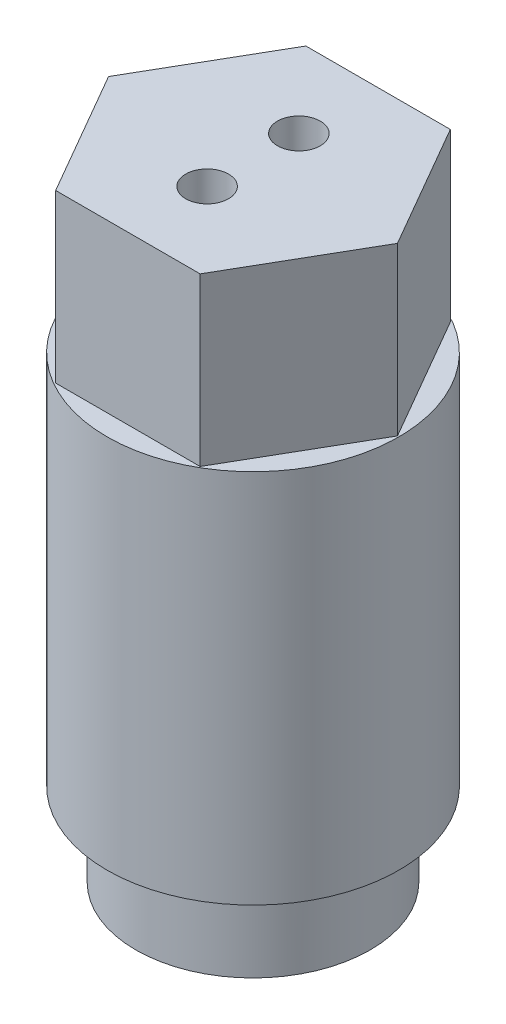
ISO-10303-21;
HEADER;
FILE_DESCRIPTION(('STEP AP214'),'2;1');
FILE_NAME('part.step','',(''),(''),'','','');
FILE_SCHEMA(('AUTOMOTIVE_DESIGN { 1 0 10303 214 1 1 1 1 }'));
ENDSEC;
DATA;
#1=APPLICATION_CONTEXT('core data for automotive mechanical design processes');
#2=APPLICATION_PROTOCOL_DEFINITION('international standard','automotive_design',2000,#1);
#3=PRODUCT_CONTEXT('',#1,'mechanical');
#4=PRODUCT('Part','Part','',(#3));
#5=PRODUCT_RELATED_PRODUCT_CATEGORY('part','',(#4));
#6=PRODUCT_DEFINITION_FORMATION('','',#4);
#7=PRODUCT_DEFINITION_CONTEXT('part definition',#1,'design');
#8=PRODUCT_DEFINITION('design','',#6,#7);
#9=PRODUCT_DEFINITION_SHAPE('','',#8);
#10=(LENGTH_UNIT() NAMED_UNIT(*) SI_UNIT(.MILLI.,.METRE.));
#11=(NAMED_UNIT(*) PLANE_ANGLE_UNIT() SI_UNIT($,.RADIAN.));
#12=(NAMED_UNIT(*) SI_UNIT($,.STERADIAN.) SOLID_ANGLE_UNIT());
#13=UNCERTAINTY_MEASURE_WITH_UNIT(LENGTH_MEASURE(1.E-05),#10,'distance_accuracy_value','');
#14=(GEOMETRIC_REPRESENTATION_CONTEXT(3) GLOBAL_UNCERTAINTY_ASSIGNED_CONTEXT((#13)) GLOBAL_UNIT_ASSIGNED_CONTEXT((#10,
#11,#12)) REPRESENTATION_CONTEXT('',''));
#15=CARTESIAN_POINT('',(0.,0.,0.));
#16=DIRECTION('',(0.,0.,1.));
#17=DIRECTION('',(1.,0.,0.));
#18=AXIS2_PLACEMENT_3D('',#15,#16,#17);
#19=CARTESIAN_POINT('',(0.,28.575,0.));
#20=DIRECTION('',(0.,-1.,0.));
#21=DIRECTION('',(0.,0.,-1.));
#22=AXIS2_PLACEMENT_3D('',#19,#20,#21);
#23=CYLINDRICAL_SURFACE('',#22,11.1125);
#24=CARTESIAN_POINT('',(0.,28.575,0.));
#25=DIRECTION('',(0.,1.,0.));
#26=DIRECTION('',(0.,0.,1.));
#27=AXIS2_PLACEMENT_3D('',#24,#25,#26);
#28=CIRCLE('',#27,11.1125);
#29=CARTESIAN_POINT('',(0.,28.575,11.1125));
#30=VERTEX_POINT('',#29);
#31=EDGE_CURVE('E11',#30,#30,#28,.T.);
#32=ORIENTED_EDGE('',*,*,#31,.F.);
#33=EDGE_LOOP('',(#32));
#34=FACE_BOUND('',#33,.T.);
#35=CARTESIAN_POINT('',(0.,0.,0.));
#36=DIRECTION('',(0.,1.,0.));
#37=DIRECTION('',(0.,0.,1.));
#38=AXIS2_PLACEMENT_3D('',#35,#36,#37);
#39=CIRCLE('',#38,11.1125);
#40=CARTESIAN_POINT('',(0.,0.,11.1125));
#41=VERTEX_POINT('',#40);
#42=EDGE_CURVE('E47',#41,#41,#39,.T.);
#43=ORIENTED_EDGE('',*,*,#42,.T.);
#44=EDGE_LOOP('',(#43));
#45=FACE_BOUND('',#44,.T.);
#46=ADVANCED_FACE('F44',(#34,#45),#23,.T.);
#47=CARTESIAN_POINT('',(0.,28.575,0.));
#48=DIRECTION('',(0.,1.,0.));
#49=DIRECTION('',(0.,0.,1.));
#50=AXIS2_PLACEMENT_3D('',#47,#48,#49);
#51=PLANE('',#50);
#52=DIRECTION('',(-0.5,0.,-0.866025403784438));
#53=VECTOR('',#52,1.);
#54=CARTESIAN_POINT('',(10.9985226280624,28.575,0.));
#55=LINE('',#54,#53);
#56=CARTESIAN_POINT('',(10.9985226280624,28.575,0.));
#57=VERTEX_POINT('',#56);
#58=CARTESIAN_POINT('',(5.49926131403118,28.575,-9.525));
#59=VERTEX_POINT('',#58);
#60=EDGE_CURVE('E119',#57,#59,#55,.T.);
#61=ORIENTED_EDGE('',*,*,#60,.F.);
#62=DIRECTION('',(0.5,0.,-0.866025403784439));
#63=VECTOR('',#62,1.);
#64=CARTESIAN_POINT('',(5.49926131403118,28.575,9.525));
#65=LINE('',#64,#63);
#66=CARTESIAN_POINT('',(5.49926131403118,28.575,9.525));
#67=VERTEX_POINT('',#66);
#68=EDGE_CURVE('E128',#67,#57,#65,.T.);
#69=ORIENTED_EDGE('',*,*,#68,.F.);
#70=DIRECTION('',(1.,0.,0.));
#71=VECTOR('',#70,1.);
#72=CARTESIAN_POINT('',(-5.49926131403119,28.575,9.525));
#73=LINE('',#72,#71);
#74=CARTESIAN_POINT('',(-5.49926131403119,28.575,9.525));
#75=VERTEX_POINT('',#74);
#76=EDGE_CURVE('E150',#75,#67,#73,.T.);
#77=ORIENTED_EDGE('',*,*,#76,.F.);
#78=DIRECTION('',(0.5,0.,0.866025403784439));
#79=VECTOR('',#78,1.);
#80=CARTESIAN_POINT('',(-10.9985226280624,28.575,0.));
#81=LINE('',#80,#79);
#82=CARTESIAN_POINT('',(-10.9985226280624,28.575,0.));
#83=VERTEX_POINT('',#82);
#84=EDGE_CURVE('E147',#83,#75,#81,.T.);
#85=ORIENTED_EDGE('',*,*,#84,.F.);
#86=DIRECTION('',(-0.5,0.,0.866025403784439));
#87=VECTOR('',#86,1.);
#88=CARTESIAN_POINT('',(-5.49926131403119,28.575,-9.525));
#89=LINE('',#88,#87);
#90=CARTESIAN_POINT('',(-5.49926131403119,28.575,-9.525));
#91=VERTEX_POINT('',#90);
#92=EDGE_CURVE('E144',#91,#83,#89,.T.);
#93=ORIENTED_EDGE('',*,*,#92,.F.);
#94=DIRECTION('',(-1.,0.,0.));
#95=VECTOR('',#94,1.);
#96=CARTESIAN_POINT('',(5.49926131403118,28.575,-9.525));
#97=LINE('',#96,#95);
#98=EDGE_CURVE('E141',#59,#91,#97,.T.);
#99=ORIENTED_EDGE('',*,*,#98,.F.);
#100=EDGE_LOOP('',(#61,#69,#77,#85,#93,#99));
#101=FACE_BOUND('',#100,.T.);
#102=ORIENTED_EDGE('',*,*,#31,.T.);
#103=EDGE_LOOP('',(#102));
#104=FACE_BOUND('',#103,.T.);
#105=ADVANCED_FACE('F181',(#101,#104),#51,.T.);
#106=CARTESIAN_POINT('',(0.,0.,0.));
#107=DIRECTION('',(0.,1.,0.));
#108=DIRECTION('',(0.,0.,1.));
#109=AXIS2_PLACEMENT_3D('',#106,#107,#108);
#110=PLANE('',#109);
#111=ORIENTED_EDGE('',*,*,#42,.F.);
#112=EDGE_LOOP('',(#111));
#113=FACE_BOUND('',#112,.T.);
#114=CARTESIAN_POINT('',(0.,0.,0.));
#115=DIRECTION('',(0.,1.,0.));
#116=DIRECTION('',(0.,0.,1.));
#117=AXIS2_PLACEMENT_3D('',#114,#115,#116);
#118=CIRCLE('',#117,7.69620000568349);
#119=CARTESIAN_POINT('',(0.,0.,7.69620000568349));
#120=VERTEX_POINT('',#119);
#121=EDGE_CURVE('E184',#120,#120,#118,.T.);
#122=ORIENTED_EDGE('',*,*,#121,.T.);
#123=EDGE_LOOP('',(#122));
#124=FACE_BOUND('',#123,.T.);
#125=ADVANCED_FACE('F177',(#113,#124),#110,.F.);
#126=CARTESIAN_POINT('',(10.9985226280624,41.275,0.));
#127=DIRECTION('',(-0.866025403784438,0.,0.5));
#128=DIRECTION('',(0.5,0.,0.866025403784438));
#129=AXIS2_PLACEMENT_3D('',#126,#127,#128);
#130=PLANE('',#129);
#131=ORIENTED_EDGE('',*,*,#60,.T.);
#132=DIRECTION('',(0.,-1.,0.));
#133=VECTOR('',#132,1.);
#134=CARTESIAN_POINT('',(5.49926131403118,41.275,-9.525));
#135=LINE('',#134,#133);
#136=CARTESIAN_POINT('',(5.49926131403118,41.275,-9.525));
#137=VERTEX_POINT('',#136);
#138=EDGE_CURVE('E169',#137,#59,#135,.T.);
#139=ORIENTED_EDGE('',*,*,#138,.F.);
#140=DIRECTION('',(-0.5,0.,-0.866025403784438));
#141=VECTOR('',#140,1.);
#142=CARTESIAN_POINT('',(10.9985226280624,41.275,0.));
#143=LINE('',#142,#141);
#144=CARTESIAN_POINT('',(10.9985226280624,41.275,0.));
#145=VERTEX_POINT('',#144);
#146=EDGE_CURVE('E124',#145,#137,#143,.T.);
#147=ORIENTED_EDGE('',*,*,#146,.F.);
#148=DIRECTION('',(0.,-1.,0.));
#149=VECTOR('',#148,1.);
#150=CARTESIAN_POINT('',(10.9985226280624,41.275,0.));
#151=LINE('',#150,#149);
#152=EDGE_CURVE('E138',#145,#57,#151,.T.);
#153=ORIENTED_EDGE('',*,*,#152,.T.);
#154=EDGE_LOOP('',(#131,#139,#147,#153));
#155=FACE_BOUND('',#154,.T.);
#156=ADVANCED_FACE('F180',(#155),#130,.F.);
#157=CARTESIAN_POINT('',(5.49926131403118,41.275,-9.525));
#158=DIRECTION('',(0.,0.,1.));
#159=DIRECTION('',(1.,0.,0.));
#160=AXIS2_PLACEMENT_3D('',#157,#158,#159);
#161=PLANE('',#160);
#162=ORIENTED_EDGE('',*,*,#98,.T.);
#163=DIRECTION('',(0.,-1.,0.));
#164=VECTOR('',#163,1.);
#165=CARTESIAN_POINT('',(-5.49926131403119,41.275,-9.525));
#166=LINE('',#165,#164);
#167=CARTESIAN_POINT('',(-5.49926131403119,41.275,-9.525));
#168=VERTEX_POINT('',#167);
#169=EDGE_CURVE('E166',#168,#91,#166,.T.);
#170=ORIENTED_EDGE('',*,*,#169,.F.);
#171=DIRECTION('',(-1.,0.,0.));
#172=VECTOR('',#171,1.);
#173=CARTESIAN_POINT('',(5.49926131403118,41.275,-9.525));
#174=LINE('',#173,#172);
#175=EDGE_CURVE('E127',#137,#168,#174,.T.);
#176=ORIENTED_EDGE('',*,*,#175,.F.);
#177=ORIENTED_EDGE('',*,*,#138,.T.);
#178=EDGE_LOOP('',(#162,#170,#176,#177));
#179=FACE_BOUND('',#178,.T.);
#180=ADVANCED_FACE('F250',(#179),#161,.F.);
#181=CARTESIAN_POINT('',(-5.49926131403119,41.275,-9.525));
#182=DIRECTION('',(0.866025403784439,0.,0.5));
#183=DIRECTION('',(0.5,0.,-0.866025403784439));
#184=AXIS2_PLACEMENT_3D('',#181,#182,#183);
#185=PLANE('',#184);
#186=ORIENTED_EDGE('',*,*,#92,.T.);
#187=DIRECTION('',(0.,-1.,0.));
#188=VECTOR('',#187,1.);
#189=CARTESIAN_POINT('',(-10.9985226280624,41.275,0.));
#190=LINE('',#189,#188);
#191=CARTESIAN_POINT('',(-10.9985226280624,41.275,0.));
#192=VERTEX_POINT('',#191);
#193=EDGE_CURVE('E163',#192,#83,#190,.T.);
#194=ORIENTED_EDGE('',*,*,#193,.F.);
#195=DIRECTION('',(-0.5,0.,0.866025403784439));
#196=VECTOR('',#195,1.);
#197=CARTESIAN_POINT('',(-5.49926131403119,41.275,-9.525));
#198=LINE('',#197,#196);
#199=EDGE_CURVE('E130',#168,#192,#198,.T.);
#200=ORIENTED_EDGE('',*,*,#199,.F.);
#201=ORIENTED_EDGE('',*,*,#169,.T.);
#202=EDGE_LOOP('',(#186,#194,#200,#201));
#203=FACE_BOUND('',#202,.T.);
#204=ADVANCED_FACE('F254',(#203),#185,.F.);
#205=CARTESIAN_POINT('',(-10.9985226280624,41.275,0.));
#206=DIRECTION('',(0.866025403784439,0.,-0.5));
#207=DIRECTION('',(-0.5,0.,-0.866025403784439));
#208=AXIS2_PLACEMENT_3D('',#205,#206,#207);
#209=PLANE('',#208);
#210=ORIENTED_EDGE('',*,*,#84,.T.);
#211=DIRECTION('',(0.,-1.,0.));
#212=VECTOR('',#211,1.);
#213=CARTESIAN_POINT('',(-5.49926131403119,41.275,9.525));
#214=LINE('',#213,#212);
#215=CARTESIAN_POINT('',(-5.49926131403119,41.275,9.525));
#216=VERTEX_POINT('',#215);
#217=EDGE_CURVE('E160',#216,#75,#214,.T.);
#218=ORIENTED_EDGE('',*,*,#217,.F.);
#219=DIRECTION('',(0.5,0.,0.866025403784439));
#220=VECTOR('',#219,1.);
#221=CARTESIAN_POINT('',(-10.9985226280624,41.275,0.));
#222=LINE('',#221,#220);
#223=EDGE_CURVE('E132',#192,#216,#222,.T.);
#224=ORIENTED_EDGE('',*,*,#223,.F.);
#225=ORIENTED_EDGE('',*,*,#193,.T.);
#226=EDGE_LOOP('',(#210,#218,#224,#225));
#227=FACE_BOUND('',#226,.T.);
#228=ADVANCED_FACE('F257',(#227),#209,.F.);
#229=CARTESIAN_POINT('',(-5.49926131403119,41.275,9.525));
#230=DIRECTION('',(0.,0.,-1.));
#231=DIRECTION('',(-1.,0.,0.));
#232=AXIS2_PLACEMENT_3D('',#229,#230,#231);
#233=PLANE('',#232);
#234=ORIENTED_EDGE('',*,*,#76,.T.);
#235=DIRECTION('',(0.,-1.,0.));
#236=VECTOR('',#235,1.);
#237=CARTESIAN_POINT('',(5.49926131403118,41.275,9.525));
#238=LINE('',#237,#236);
#239=CARTESIAN_POINT('',(5.49926131403118,41.275,9.525));
#240=VERTEX_POINT('',#239);
#241=EDGE_CURVE('E157',#240,#67,#238,.T.);
#242=ORIENTED_EDGE('',*,*,#241,.F.);
#243=DIRECTION('',(1.,0.,0.));
#244=VECTOR('',#243,1.);
#245=CARTESIAN_POINT('',(-5.49926131403119,41.275,9.525));
#246=LINE('',#245,#244);
#247=EDGE_CURVE('E134',#216,#240,#246,.T.);
#248=ORIENTED_EDGE('',*,*,#247,.F.);
#249=ORIENTED_EDGE('',*,*,#217,.T.);
#250=EDGE_LOOP('',(#234,#242,#248,#249));
#251=FACE_BOUND('',#250,.T.);
#252=ADVANCED_FACE('F261',(#251),#233,.F.);
#253=CARTESIAN_POINT('',(5.49926131403118,41.275,9.525));
#254=DIRECTION('',(-0.866025403784439,0.,-0.5));
#255=DIRECTION('',(-0.5,0.,0.866025403784439));
#256=AXIS2_PLACEMENT_3D('',#253,#254,#255);
#257=PLANE('',#256);
#258=ORIENTED_EDGE('',*,*,#68,.T.);
#259=ORIENTED_EDGE('',*,*,#152,.F.);
#260=DIRECTION('',(0.5,0.,-0.866025403784439));
#261=VECTOR('',#260,1.);
#262=CARTESIAN_POINT('',(5.49926131403118,41.275,9.525));
#263=LINE('',#262,#261);
#264=EDGE_CURVE('E136',#240,#145,#263,.T.);
#265=ORIENTED_EDGE('',*,*,#264,.F.);
#266=ORIENTED_EDGE('',*,*,#241,.T.);
#267=EDGE_LOOP('',(#258,#259,#265,#266));
#268=FACE_BOUND('',#267,.T.);
#269=ADVANCED_FACE('F265',(#268),#257,.F.);
#270=CARTESIAN_POINT('',(0.,41.275,0.));
#271=DIRECTION('',(0.,1.,0.));
#272=DIRECTION('',(0.,0.,1.));
#273=AXIS2_PLACEMENT_3D('',#270,#271,#272);
#274=PLANE('',#273);
#275=CARTESIAN_POINT('',(0.,41.275,-3.4925));
#276=DIRECTION('',(0.,-1.,0.));
#277=DIRECTION('',(0.,0.,-1.));
#278=AXIS2_PLACEMENT_3D('',#275,#276,#277);
#279=CIRCLE('',#278,1.63195);
#280=CARTESIAN_POINT('',(0.,41.275,-5.12445));
#281=VERTEX_POINT('',#280);
#282=EDGE_CURVE('E292',#281,#281,#279,.T.);
#283=ORIENTED_EDGE('',*,*,#282,.T.);
#284=EDGE_LOOP('',(#283));
#285=FACE_BOUND('',#284,.T.);
#286=CARTESIAN_POINT('',(0.,41.275,3.4925));
#287=DIRECTION('',(0.,-1.,0.));
#288=DIRECTION('',(0.,0.,-1.));
#289=AXIS2_PLACEMENT_3D('',#286,#287,#288);
#290=CIRCLE('',#289,1.63195);
#291=CARTESIAN_POINT('',(0.,41.275,1.86055));
#292=VERTEX_POINT('',#291);
#293=EDGE_CURVE('E286',#292,#292,#290,.T.);
#294=ORIENTED_EDGE('',*,*,#293,.T.);
#295=EDGE_LOOP('',(#294));
#296=FACE_BOUND('',#295,.T.);
#297=ORIENTED_EDGE('',*,*,#146,.T.);
#298=ORIENTED_EDGE('',*,*,#175,.T.);
#299=ORIENTED_EDGE('',*,*,#199,.T.);
#300=ORIENTED_EDGE('',*,*,#223,.T.);
#301=ORIENTED_EDGE('',*,*,#247,.T.);
#302=ORIENTED_EDGE('',*,*,#264,.T.);
#303=EDGE_LOOP('',(#297,#298,#299,#300,#301,#302));
#304=FACE_BOUND('',#303,.T.);
#305=ADVANCED_FACE('F269',(#285,#296,#304),#274,.T.);
#306=CARTESIAN_POINT('',(0.,-6.35,0.));
#307=DIRECTION('',(0.,1.,0.));
#308=DIRECTION('',(0.,0.,1.));
#309=AXIS2_PLACEMENT_3D('',#306,#307,#308);
#310=CYLINDRICAL_SURFACE('',#309,8.9281);
#311=CARTESIAN_POINT('',(0.,-0.7112378,0.));
#312=DIRECTION('',(0.,1.,0.));
#313=DIRECTION('',(0.,0.,1.));
#314=AXIS2_PLACEMENT_3D('',#311,#312,#313);
#315=CIRCLE('',#314,8.9281);
#316=CARTESIAN_POINT('',(0.,-0.7112378,8.9281));
#317=VERTEX_POINT('',#316);
#318=EDGE_CURVE('E187',#317,#317,#315,.T.);
#319=ORIENTED_EDGE('',*,*,#318,.F.);
#320=EDGE_LOOP('',(#319));
#321=FACE_BOUND('',#320,.T.);
#322=CARTESIAN_POINT('',(0.,-6.35,0.));
#323=DIRECTION('',(0.,-1.,0.));
#324=DIRECTION('',(0.,0.,-1.));
#325=AXIS2_PLACEMENT_3D('',#322,#323,#324);
#326=CIRCLE('',#325,8.9281);
#327=CARTESIAN_POINT('',(0.,-6.35,-8.9281));
#328=VERTEX_POINT('',#327);
#329=EDGE_CURVE('E117',#328,#328,#326,.T.);
#330=ORIENTED_EDGE('',*,*,#329,.F.);
#331=EDGE_LOOP('',(#330));
#332=FACE_BOUND('',#331,.T.);
#333=ADVANCED_FACE('F273',(#321,#332),#310,.T.);
#334=CARTESIAN_POINT('',(0.,-6.35,0.));
#335=DIRECTION('',(0.,-1.,0.));
#336=DIRECTION('',(0.,0.,-1.));
#337=AXIS2_PLACEMENT_3D('',#334,#335,#336);
#338=PLANE('',#337);
#339=CARTESIAN_POINT('',(0.,-6.35,0.));
#340=DIRECTION('',(0.,-1.,0.));
#341=DIRECTION('',(0.,0.,-1.));
#342=AXIS2_PLACEMENT_3D('',#339,#340,#341);
#343=CIRCLE('',#342,6.34999999999999);
#344=CARTESIAN_POINT('',(0.,-6.35,-6.34999999999999));
#345=VERTEX_POINT('',#344);
#346=EDGE_CURVE('E114',#345,#345,#343,.T.);
#347=ORIENTED_EDGE('',*,*,#346,.F.);
#348=EDGE_LOOP('',(#347));
#349=FACE_BOUND('',#348,.T.);
#350=ORIENTED_EDGE('',*,*,#329,.T.);
#351=EDGE_LOOP('',(#350));
#352=FACE_BOUND('',#351,.T.);
#353=ADVANCED_FACE('F105',(#349,#352),#338,.T.);
#354=CARTESIAN_POINT('',(0.,24.759535069175,0.));
#355=DIRECTION('',(0.,-1.,0.));
#356=DIRECTION('',(0.,0.,-1.));
#357=AXIS2_PLACEMENT_3D('',#354,#355,#356);
#358=CONICAL_SURFACE('',#357,6.34999999999999,1.02974425867665);
#359=CARTESIAN_POINT('',(0.,28.575,0.));
#360=VERTEX_POINT('',#359);
#361=VERTEX_LOOP('',#360);
#362=FACE_BOUND('',#361,.T.);
#363=CARTESIAN_POINT('',(0.,24.759535069175,0.));
#364=DIRECTION('',(0.,-1.,0.));
#365=DIRECTION('',(0.,0.,-1.));
#366=AXIS2_PLACEMENT_3D('',#363,#364,#365);
#367=CIRCLE('',#366,6.34999999999999);
#368=CARTESIAN_POINT('',(0.,24.759535069175,6.34999999999999));
#369=VERTEX_POINT('',#368);
#370=CARTESIAN_POINT('',(0.,24.759535069175,-6.34999999999999));
#371=VERTEX_POINT('',#370);
#372=EDGE_CURVE('E109',#369,#371,#367,.T.);
#373=ORIENTED_EDGE('',*,*,#372,.T.);
#374=CARTESIAN_POINT('',(-2.12664299759173,25.0871954921764,-5.40108476646814));
#375=CARTESIAN_POINT('',(-2.23846037295355,25.1322413075604,-5.27648419595228));
#376=CARTESIAN_POINT('',(-2.33858096757132,25.1814312567212,-5.14282956546129));
#377=CARTESIAN_POINT('',(-2.51318670221022,25.2872912956615,-4.86236505142527));
#378=CARTESIAN_POINT('',(-2.58765588543493,25.3439660112263,-4.71554705073262));
#379=CARTESIAN_POINT('',(-2.70963998923854,25.4637978319487,-4.41418641417808));
#380=CARTESIAN_POINT('',(-2.75722926745167,25.5269364779785,-4.25966638757051));
#381=CARTESIAN_POINT('',(-2.8256059686795,25.659021048249,-3.94728930952049));
#382=CARTESIAN_POINT('',(-2.84639423835688,25.7279667889662,-3.78943236365379));
#383=CARTESIAN_POINT('',(-2.86220999114231,25.8748966248964,-3.46600899481421));
#384=CARTESIAN_POINT('',(-2.85574156897064,25.9531700843033,-3.30050168673523));
#385=CARTESIAN_POINT('',(-2.81508890284434,26.1145116874024,-2.97533910877659));
#386=CARTESIAN_POINT('',(-2.78089465270973,26.1975815520503,-2.81568597339902));
#387=CARTESIAN_POINT('',(-2.68348847448705,26.3737399559297,-2.49543509864929));
#388=CARTESIAN_POINT('',(-2.61839384394084,26.4671214429146,-2.33557045530971));
#389=CARTESIAN_POINT('',(-2.46185091569495,26.6574612248176,-2.03173242761895));
#390=CARTESIAN_POINT('',(-2.37039743031442,26.7544202205457,-1.88776217916202));
#391=CARTESIAN_POINT('',(-2.15791194043633,26.9572599328709,-1.61072804464417));
#392=CARTESIAN_POINT('',(-2.03536729461402,27.0633156139409,-1.47894239470937));
#393=CARTESIAN_POINT('',(-1.8354124452997,27.2233799970871,-1.30056315143068));
#394=CARTESIAN_POINT('',(-1.76602050655992,27.2769336156279,-1.24428946533047));
#395=CARTESIAN_POINT('',(-1.62231897548546,27.3841315430701,-1.13849578944376));
#396=CARTESIAN_POINT('',(-1.54801041846045,27.4377758305754,-1.08897438448549));
#397=CARTESIAN_POINT('',(-1.40525876225021,27.5375514416632,-1.00321769194902));
#398=CARTESIAN_POINT('',(-1.33737460282511,27.5837210641243,-0.966091288262816));
#399=CARTESIAN_POINT('',(-1.19845715631155,27.6754569832397,-0.89730912824796));
#400=CARTESIAN_POINT('',(-1.12742284777422,27.7210230778853,-0.865655162920026));
#401=CARTESIAN_POINT('',(-0.982294739507047,27.8108813523633,-0.808006333332228));
#402=CARTESIAN_POINT('',(-0.908201059555941,27.8551735819543,-0.782011247768646));
#403=CARTESIAN_POINT('',(-0.794632395276379,27.9195899598528,-0.747426687446017));
#404=CARTESIAN_POINT('',(-0.756385730113449,27.940717827513,-0.736636280002973));
#405=CARTESIAN_POINT('',(-0.678972778573323,27.9819955169009,-0.716549284200653));
#406=CARTESIAN_POINT('',(-0.639806461060978,28.0021453054445,-0.707252746500671));
#407=CARTESIAN_POINT('',(-0.568692426243631,28.036946969438,-0.691977202771454));
#408=CARTESIAN_POINT('',(-0.536939626469249,28.0518700477498,-0.68571047066952));
#409=CARTESIAN_POINT('',(-0.472694070587207,28.0804450896381,-0.67417932612234));
#410=CARTESIAN_POINT('',(-0.440201561950365,28.0940974707711,-0.668914583820549));
#411=CARTESIAN_POINT('',(-0.374486776315688,28.1195863447859,-0.659451441425064));
#412=CARTESIAN_POINT('',(-0.341267536452712,28.1314291780769,-0.655249282617722));
#413=CARTESIAN_POINT('',(-0.273928695030423,28.1526604357654,-0.64795886982216));
#414=CARTESIAN_POINT('',(-0.239809588105914,28.1620501788375,-0.644870017028646));
#415=CARTESIAN_POINT('',(-0.180481873631395,28.175345519,-0.640597061495941));
#416=CARTESIAN_POINT('',(-0.155475048307056,28.1800509580596,-0.639121437467662));
#417=CARTESIAN_POINT('',(-0.105139734828962,28.1874548731418,-0.636823917901088));
#418=CARTESIAN_POINT('',(-0.0798113926448304,28.1901542289663,-0.636001735773722));
#419=CARTESIAN_POINT('',(-0.0290652282494052,28.1933327819225,-0.635035463593242));
#420=CARTESIAN_POINT('',(-0.00364780795079561,28.1938177137002,-0.634889622020363));
#421=CARTESIAN_POINT('',(0.047126344731146,28.1925429251238,-0.635275768216819));
#422=CARTESIAN_POINT('',(0.0724830683523559,28.1907828982116,-0.635807848559062));
#423=CARTESIAN_POINT('',(0.129453969657336,28.1844316392706,-0.637757242271303));
#424=CARTESIAN_POINT('',(0.160992815358319,28.1792265733584,-0.639367699024206));
#425=CARTESIAN_POINT('',(0.223430362200437,28.1660404144552,-0.643576195907396));
#426=CARTESIAN_POINT('',(0.254328347376523,28.1580563770018,-0.646175283815119));
#427=CARTESIAN_POINT('',(0.315618114618752,28.1398822801969,-0.652315585717333));
#428=CARTESIAN_POINT('',(0.346004233946811,28.1296758502436,-0.655863838321444));
#429=CARTESIAN_POINT('',(0.406050489466419,28.1076504940499,-0.663834872832706));
#430=CARTESIAN_POINT('',(0.435710784541532,28.0958319245003,-0.668257461387329));
#431=CARTESIAN_POINT('',(0.504656677751439,28.0666646609015,-0.679629555700411));
#432=CARTESIAN_POINT('',(0.543678143587425,28.0488281000857,-0.686921735697788));
#433=CARTESIAN_POINT('',(0.620719521274688,28.0117104238751,-0.702955112970444));
#434=CARTESIAN_POINT('',(0.658739210369311,27.9924289907996,-0.711696629423279));
#435=CARTESIAN_POINT('',(0.771598798948421,27.9330855767946,-0.740051614164111));
#436=CARTESIAN_POINT('',(0.845147905291342,27.891565894887,-0.761780112590294));
#437=CARTESIAN_POINT('',(0.989287988415232,27.8066815035626,-0.810635481428585));
#438=CARTESIAN_POINT('',(1.05987896331401,27.7633167929718,-0.837762355275502));
#439=CARTESIAN_POINT('',(1.19815227236435,27.6756622002175,-0.897235744652615));
#440=CARTESIAN_POINT('',(1.26583658009344,27.6313729771467,-0.929578645296516));
#441=CARTESIAN_POINT('',(1.40080564507217,27.5406234637919,-1.00069559894589));
#442=CARTESIAN_POINT('',(1.46797287793989,27.4941456393611,-1.03967057855149));
#443=CARTESIAN_POINT('',(1.59885271182327,27.4010541705752,-1.12290204456733));
#444=CARTESIAN_POINT('',(1.66256470862424,27.3544405039576,-1.16715945040828));
#445=CARTESIAN_POINT('',(1.84793352311946,27.214846374068,-1.30745318045342));
#446=CARTESIAN_POINT('',(1.96402283296709,27.121978143993,-1.41111650039977));
#447=CARTESIAN_POINT('',(2.20051323991691,26.9189071567486,-1.65994898607149));
#448=CARTESIAN_POINT('',(2.31688682183497,26.8090693370492,-1.80926958715146));
#449=CARTESIAN_POINT('',(2.51895308391179,26.5931801937141,-2.13009789878299));
#450=CARTESIAN_POINT('',(2.60462084183912,26.4871320084791,-2.30162347890615));
#451=CARTESIAN_POINT('',(2.73858754514712,26.2833753361572,-2.65572215703513));
#452=CARTESIAN_POINT('',(2.78793008367565,26.1855121242158,-2.83780970159698));
#453=CARTESIAN_POINT('',(2.84990454081526,25.9959879950338,-3.21121711977384));
#454=CARTESIAN_POINT('',(2.86255751406158,25.9043235500865,-3.40253163429697));
#455=CARTESIAN_POINT('',(2.84920818915305,25.7340310712588,-3.77508813549767));
#456=CARTESIAN_POINT('',(2.82559173940359,25.6549455281758,-3.95620506643117));
#457=CARTESIAN_POINT('',(2.74311383667071,25.5044927519066,-4.31360746608459));
#458=CARTESIAN_POINT('',(2.68426634135334,25.4331224753355,-4.4898948192549));
#459=CARTESIAN_POINT('',(2.53753360546345,25.304326671404,-4.81765173275336));
#460=CARTESIAN_POINT('',(2.45215713977431,25.2462567519183,-4.96999101432326));
#461=CARTESIAN_POINT('',(2.25326568626552,25.1387092893021,-5.25849801281202));
#462=CARTESIAN_POINT('',(2.13976433224823,25.0892276026504,-5.39467351810516));
#463=CARTESIAN_POINT('',(1.89678815817631,25.003030479261,-5.63601951495398));
#464=CARTESIAN_POINT('',(1.76907141067421,24.965648991269,-5.74272327765317));
#465=CARTESIAN_POINT('',(1.49547750741998,24.8997384633598,-5.93311304281989));
#466=CARTESIAN_POINT('',(1.3496072988179,24.8712060514973,-6.01680781149298));
#467=CARTESIAN_POINT('',(1.05310568891913,24.8249398320674,-6.15358412217997));
#468=CARTESIAN_POINT('',(0.903248774403449,24.8066730627908,-6.20816701109644));
#469=CARTESIAN_POINT('',(0.595794052496211,24.7788146221845,-6.29173059559488));
#470=CARTESIAN_POINT('',(0.438198174637493,24.7692207999169,-6.3207176390441));
#471=CARTESIAN_POINT('',(0.125804636457384,24.7590736241034,-6.35138686869367));
#472=CARTESIAN_POINT('',(-0.0288914446725005,24.7582091400069,-6.3540087461271));
#473=CARTESIAN_POINT('',(-0.336506041246116,24.7647262326895,-6.33429816109535));
#474=CARTESIAN_POINT('',(-0.48942465290423,24.7721073610137,-6.31196705575035));
#475=CARTESIAN_POINT('',(-0.78770859817001,24.7948758675833,-6.24350487446505));
#476=CARTESIAN_POINT('',(-0.933130394421178,24.8101891086377,-6.19759421705361));
#477=CARTESIAN_POINT('',(-1.21395254567833,24.8485131813721,-6.08374979080432));
#478=CARTESIAN_POINT('',(-1.34935462571968,24.871522684249,-6.01581982378682));
#479=CARTESIAN_POINT('',(-1.59969064279192,24.9234069216146,-5.86452725895654));
#480=CARTESIAN_POINT('',(-1.71533755047751,24.9518941915719,-5.78220605056448));
#481=CARTESIAN_POINT('',(-1.93224479543498,25.0150267214879,-5.60238120690907));
#482=CARTESIAN_POINT('',(-2.03350179731207,25.0496734049438,-5.50487406268282));
#483=CARTESIAN_POINT('',(-2.12664299759173,25.0871954921764,-5.40108476646814));
#484=B_SPLINE_CURVE_WITH_KNOTS('',3,(#374,#375,#376,#377,#378,#379,#380,#381,#382,#383,#384,
#385,#386,#387,#388,#389,#390,#391,#392,#393,#394,#395,#396,#397,#398,#399,#400,#401,#402,#403,
#404,#405,#406,#407,#408,#409,#410,#411,#412,#413,#414,#415,#416,#417,#418,#419,#420,#421,#422,
#423,#424,#425,#426,#427,#428,#429,#430,#431,#432,#433,#434,#435,#436,#437,#438,#439,#440,#441,
#442,#443,#444,#445,#446,#447,#448,#449,#450,#451,#452,#453,#454,#455,#456,#457,#458,#459,#460,
#461,#462,#463,#464,#465,#466,#467,#468,#469,#470,#471,#472,#473,#474,#475,#476,#477,#478,#479,
#480,#481,#482,#483),.UNSPECIFIED.,.T.,.F.,(4,2,2,2,2,2,2,2,2,2,2,2,2,2,2,2,2,2,2,2,2,2,2,2,2,2,
2,2,2,2,2,2,2,2,2,2,2,2,2,2,2,2,2,2,2,2,2,2,2,2,2,2,2,2,4),(0.,0.519556891473366,
1.03943639890413,1.55787063519847,2.07628849338979,2.62351822406017,3.1709455364827,
3.75712287544622,4.34341565872107,4.9670415436145,5.2792631582329,5.59141923520428,
5.86151122413858,6.13169144119471,6.4018610903232,6.53684847342782,6.67184043318513,
6.77872590376898,6.88557612640029,6.99204292319186,7.09845236975333,7.17484143118663,
7.25119697109374,7.32735466215502,7.40352275396396,7.49936350422218,7.59530611333878,
7.69198092386338,7.78863437937892,7.91911309182303,8.04962057697065,8.31093872656662,
8.57225704243127,8.83339502785875,9.10467104079249,9.37599433961521,9.91785914733019,
10.5712157488396,11.2251014495767,11.8593780909533,12.4932906749013,13.0872533224869,
13.6809808123824,14.230179887887,14.7791132530568,15.2881913408583,15.797075205161,
16.2762651445464,16.7553362095951,17.2172692848166,17.6791772380641,18.1368438669541,
18.5944315178757,19.0271098603335,19.4598883290537),.UNSPECIFIED.);
#485=EDGE_CURVE('E61',#371,#371,#484,.T.);
#486=ORIENTED_EDGE('',*,*,#485,.T.);
#487=EDGE_CURVE('E113',#371,#369,#367,.T.);
#488=ORIENTED_EDGE('',*,*,#487,.T.);
#489=CARTESIAN_POINT('',(-2.46625304754833,26.6483137656707,2.04927369915229));
#490=CARTESIAN_POINT('',(-2.55668682661666,26.5471714889822,2.20382752719084));
#491=CARTESIAN_POINT('',(-2.63318890148122,26.4477405343927,2.36797909902784));
#492=CARTESIAN_POINT('',(-2.75443604904328,26.2535482561491,2.71052605866809));
#493=CARTESIAN_POINT('',(-2.79912827358897,26.158794945692,2.88894460494097));
#494=CARTESIAN_POINT('',(-2.85330474636096,25.9759102139536,3.25271193324703));
#495=CARTESIAN_POINT('',(-2.86305146388903,25.8877343193941,3.43799844548706));
#496=CARTESIAN_POINT('',(-2.84589021181405,25.7184790332655,3.81007946149266));
#497=CARTESIAN_POINT('',(-2.81900619858886,25.6373950405113,3.99687290033677));
#498=CARTESIAN_POINT('',(-2.73092046124024,25.4889184404205,4.35183935508063));
#499=CARTESIAN_POINT('',(-2.67224139832152,25.4209654498409,4.52040273333208));
#500=CARTESIAN_POINT('',(-2.52289690617089,25.2933249671725,4.84614362037992));
#501=CARTESIAN_POINT('',(-2.43224547422245,25.2336338739796,5.00332607542967));
#502=CARTESIAN_POINT('',(-2.2288543841758,25.1277359318096,5.28856936137716));
#503=CARTESIAN_POINT('',(-2.11829186271088,25.0808521867686,5.41793179534934));
#504=CARTESIAN_POINT('',(-1.87417061466622,24.9958819586956,5.65625741511391));
#505=CARTESIAN_POINT('',(-1.74062191916632,24.9577916551441,5.76522945608272));
#506=CARTESIAN_POINT('',(-1.46395929020646,24.8933522894095,5.95179045223435));
#507=CARTESIAN_POINT('',(-1.32206625815175,24.8663922927671,6.03098090462507));
#508=CARTESIAN_POINT('',(-1.02573470141887,24.8212721422943,6.16449466577193));
#509=CARTESIAN_POINT('',(-0.871300136218164,24.8031092236596,6.21882578718683));
#510=CARTESIAN_POINT('',(-0.562140226886431,24.7765734651585,6.29849122712542));
#511=CARTESIAN_POINT('',(-0.407770566201898,24.7677801384589,6.32506978191489));
#512=CARTESIAN_POINT('',(-0.0965237059477931,24.7586608221157,6.35263715686244));
#513=CARTESIAN_POINT('',(0.0603530849850934,24.7583334664087,6.35363010549689));
#514=CARTESIAN_POINT('',(0.368528451134735,24.7660639123063,6.3302554801457));
#515=CARTESIAN_POINT('',(0.519874037338295,24.7739388087578,6.30644109301244));
#516=CARTESIAN_POINT('',(0.816231756947977,24.797651826506,6.23518075002343));
#517=CARTESIAN_POINT('',(0.961244007998298,24.8134897998171,6.18773523332848));
#518=CARTESIAN_POINT('',(1.24170425516851,24.8529562608759,6.07061707264029));
#519=CARTESIAN_POINT('',(1.37710085706468,24.8766232689643,6.00083458255805));
#520=CARTESIAN_POINT('',(1.63406985567286,24.9313380201039,5.8415387755868));
#521=CARTESIAN_POINT('',(1.75564084791805,24.9623865120108,5.75202345685863));
#522=CARTESIAN_POINT('',(1.98551118800022,25.0324230765788,5.55328048808273));
#523=CARTESIAN_POINT('',(2.09330707675018,25.0716201776842,5.44354490081645));
#524=CARTESIAN_POINT('',(2.28893972163881,25.1567638715522,5.209852297368));
#525=CARTESIAN_POINT('',(2.37677261022049,25.2027117693549,5.08589253243522));
#526=CARTESIAN_POINT('',(2.53480692430818,25.3032039060911,4.82103618188593));
#527=CARTESIAN_POINT('',(2.60390697539341,25.3580631255158,4.67960261700197));
#528=CARTESIAN_POINT('',(2.71751604201726,25.4738359408013,4.38954758853548));
#529=CARTESIAN_POINT('',(2.76201904955519,25.5347510115633,4.24092437846391));
#530=CARTESIAN_POINT('',(2.82836077180402,25.6660033227135,3.93107744606622));
#531=CARTESIAN_POINT('',(2.8485708578878,25.7366938334931,3.76965511008242));
#532=CARTESIAN_POINT('',(2.86168717041619,25.8833270345756,3.44810713982731));
#533=CARTESIAN_POINT('',(2.85458436610146,25.9592714538839,3.28798195198579));
#534=CARTESIAN_POINT('',(2.81299146177439,26.1211465685688,2.96221728576944));
#535=CARTESIAN_POINT('',(2.77661090710646,26.2074039689528,2.7969816543364));
#536=CARTESIAN_POINT('',(2.67640563584038,26.3841400471744,2.47751093730519));
#537=CARTESIAN_POINT('',(2.61257798629554,26.4746191752168,2.3232770293853));
#538=CARTESIAN_POINT('',(2.4551080283218,26.6651823678073,2.01977112373239));
#539=CARTESIAN_POINT('',(2.35973724599747,26.7655016728407,1.87154507702963));
#540=CARTESIAN_POINT('',(2.1445200244,26.9689978112634,1.59594281207437));
#541=CARTESIAN_POINT('',(2.02464731420832,27.0721776081611,1.46858923956191));
#542=CARTESIAN_POINT('',(1.82593619456524,27.2308047496297,1.29256386716356));
#543=CARTESIAN_POINT('',(1.75436989673785,27.285840038511,1.23508897883722));
#544=CARTESIAN_POINT('',(1.60605152851992,27.3960061439715,1.1272718570119));
#545=CARTESIAN_POINT('',(1.52929828198701,27.4511369794361,1.07693124928206));
#546=CARTESIAN_POINT('',(1.37130704672755,27.5609116647055,0.98387198911295));
#547=CARTESIAN_POINT('',(1.29007986672243,27.615556347151,0.941135938423139));
#548=CARTESIAN_POINT('',(1.1233480790624,27.7237484598292,0.863459584346605));
#549=CARTESIAN_POINT('',(1.0378460158638,27.7772965166474,0.828514709630956));
#550=CARTESIAN_POINT('',(0.879122371545881,27.8719769243971,0.772549424364896));
#551=CARTESIAN_POINT('',(0.806648360557091,27.9135374348522,0.750145062703322));
#552=CARTESIAN_POINT('',(0.695394623262749,27.9733764352411,0.720640412497321));
#553=CARTESIAN_POINT('',(0.657840553328327,27.9929273396999,0.711480822474718));
#554=CARTESIAN_POINT('',(0.581787133720002,28.0307695021402,0.694581268018638));
#555=CARTESIAN_POINT('',(0.543287892720495,28.0490609040257,0.686841141236099));
#556=CARTESIAN_POINT('',(0.474423821601976,28.0796645532659,0.674496579532964));
#557=CARTESIAN_POINT('',(0.44429088985006,28.0923671709619,0.669583598380741));
#558=CARTESIAN_POINT('',(0.383311980611766,28.1162800420624,0.6606574772821));
#559=CARTESIAN_POINT('',(0.352465760125521,28.1274897778192,0.656644649129849));
#560=CARTESIAN_POINT('',(0.259041001729387,28.1579440487887,0.646082161224254));
#561=CARTESIAN_POINT('',(0.195171342032974,28.174208788149,0.640933987656167));
#562=CARTESIAN_POINT('',(0.104873209649313,28.1874953133514,0.636811502771917));
#563=CARTESIAN_POINT('',(0.079344785967224,28.1902035808082,0.635986702453758));
#564=CARTESIAN_POINT('',(0.0281335831979116,28.1933705250384,0.635024025522034));
#565=CARTESIAN_POINT('',(0.0024508350841071,28.1938296390569,0.634886015393419));
#566=CARTESIAN_POINT('',(-0.0488627801401643,28.192454818758,0.635302444733054));
#567=CARTESIAN_POINT('',(-0.074493600330291,28.1906193311548,0.635857353258757));
#568=CARTESIAN_POINT('',(-0.125487040101212,28.1848076125355,0.637642603514939));
#569=CARTESIAN_POINT('',(-0.15084958740005,28.1808308188411,0.638873122779665));
#570=CARTESIAN_POINT('',(-0.213081822068602,28.1686967300564,0.642713765817795));
#571=CARTESIAN_POINT('',(-0.249714764808208,28.1594516056377,0.64570123060382));
#572=CARTESIAN_POINT('',(-0.321959744477107,28.1379737984171,0.652963107398014));
#573=CARTESIAN_POINT('',(-0.357570879015891,28.1257385605068,0.657238620799069));
#574=CARTESIAN_POINT('',(-0.428032627466491,28.0990882856085,0.667014770035117));
#575=CARTESIAN_POINT('',(-0.462877301625891,28.0846604488041,0.672522695946469));
#576=CARTESIAN_POINT('',(-0.531714973684534,28.0543150099691,0.684688110520147));
#577=CARTESIAN_POINT('',(-0.565707592111862,28.0383967586028,0.691346101313749));
#578=CARTESIAN_POINT('',(-0.637855897156731,28.0031121450466,0.706822487161717));
#579=CARTESIAN_POINT('',(-0.67589375414336,27.9835818912583,0.715814418683497));
#580=CARTESIAN_POINT('',(-0.751108609663483,27.9435808763801,0.735209682003065));
#581=CARTESIAN_POINT('',(-0.788285425156966,27.9231099180259,0.745613310733076));
#582=CARTESIAN_POINT('',(-0.898693592269579,27.860706613579,0.778909477813032));
#583=CARTESIAN_POINT('',(-0.970761090688529,27.8178049861356,0.803878264711933));
#584=CARTESIAN_POINT('',(-1.11191643986852,27.730801014405,0.859122174152499));
#585=CARTESIAN_POINT('',(-1.18100795736623,27.6867002636726,0.889390519637968));
#586=CARTESIAN_POINT('',(-1.31624110478379,27.5978863641049,0.955086926713692));
#587=CARTESIAN_POINT('',(-1.38238370350462,27.5531734227959,0.990513277196748));
#588=CARTESIAN_POINT('',(-1.51995789183383,27.4576720154754,1.07130364515164));
#589=CARTESIAN_POINT('',(-1.59096064340682,27.4068487262449,1.11736076782335));
#590=CARTESIAN_POINT('',(-1.72861955696722,27.3052377583824,1.21558459995849));
#591=CARTESIAN_POINT('',(-1.79527461067102,27.2544500920697,1.26775285782595));
#592=CARTESIAN_POINT('',(-1.98787512809825,27.1026535625712,1.43285158776146));
#593=CARTESIAN_POINT('',(-2.10681040435511,27.0019653556849,1.55458438022313));
#594=CARTESIAN_POINT('',(-2.26070129941149,26.859719698284,1.74322925279413));
#595=CARTESIAN_POINT('',(-2.30498153380887,26.8170652242836,1.80199830469357));
#596=CARTESIAN_POINT('',(-2.38905419154064,26.732280729391,1.92305482308384));
#597=CARTESIAN_POINT('',(-2.42884549655597,26.6901508415033,1.9853431605529));
#598=CARTESIAN_POINT('',(-2.46625304754833,26.6483137656707,2.04927369915229));
#599=B_SPLINE_CURVE_WITH_KNOTS('',3,(#489,#490,#491,#492,#493,#494,#495,#496,#497,#498,#499,
#500,#501,#502,#503,#504,#505,#506,#507,#508,#509,#510,#511,#512,#513,#514,#515,#516,#517,#518,
#519,#520,#521,#522,#523,#524,#525,#526,#527,#528,#529,#530,#531,#532,#533,#534,#535,#536,#537,
#538,#539,#540,#541,#542,#543,#544,#545,#546,#547,#548,#549,#550,#551,#552,#553,#554,#555,#556,
#557,#558,#559,#560,#561,#562,#563,#564,#565,#566,#567,#568,#569,#570,#571,#572,#573,#574,#575,
#576,#577,#578,#579,#580,#581,#582,#583,#584,#585,#586,#587,#588,#589,#590,#591,#592,#593,#594,
#595,#596,#597,#598),.UNSPECIFIED.,.T.,.F.,(4,2,2,2,2,2,2,2,2,2,2,2,2,2,2,2,2,2,2,2,2,2,2,2,2,2,
2,2,2,2,2,2,2,2,2,2,2,2,2,2,2,2,2,2,2,2,2,2,2,2,2,2,2,2,4),(0.,0.616652235627639,
1.2343265867085,1.84735186508715,2.45997641931644,3.02989924281913,3.59957286710315,
4.12635179807168,4.65290142487063,5.14454684560754,5.63603764832019,6.10439949492532,
6.57268576650162,7.03074861200264,7.48880294518368,7.94914537251819,8.4095345217874,
8.88364336149329,9.3578439751267,9.8557585516638,10.3537946936475,10.8836318956846,
11.4136442986453,11.980921202429,12.5482587394615,13.1540737075455,13.7605416690111,
14.0813076713097,14.4021466530477,14.7222418846692,15.0421488091589,15.3013647464081,
15.4312788910947,15.5611781677587,15.66032615812,15.7595084384222,15.9565129730737,
16.0334749520846,16.110421968762,16.1874211014351,16.2644404773183,16.3779225879224,
16.4915020122997,16.6057719397733,16.7200918854776,16.8511233689041,16.9821824559518,
17.2444427456614,17.5063700752909,17.7682107107699,18.064059757326,18.3599839271989,
18.9504090184382,19.205421221735,19.4604968161251),.UNSPECIFIED.);
#600=EDGE_CURVE('E56',#369,#369,#599,.T.);
#601=ORIENTED_EDGE('',*,*,#600,.T.);
#602=EDGE_LOOP('',(#373,#486,#488,#601));
#603=FACE_BOUND('',#602,.T.);
#604=ADVANCED_FACE('F101',(#362,#603),#358,.F.);
#605=CARTESIAN_POINT('',(0.,-6.35,0.));
#606=DIRECTION('',(0.,-1.,0.));
#607=DIRECTION('',(0.,0.,-1.));
#608=AXIS2_PLACEMENT_3D('',#605,#606,#607);
#609=CYLINDRICAL_SURFACE('',#608,6.34999999999999);
#610=ORIENTED_EDGE('',*,*,#487,.F.);
#611=ORIENTED_EDGE('',*,*,#372,.F.);
#612=EDGE_LOOP('',(#610,#611));
#613=FACE_BOUND('',#612,.T.);
#614=ORIENTED_EDGE('',*,*,#346,.T.);
#615=EDGE_LOOP('',(#614));
#616=FACE_BOUND('',#615,.T.);
#617=ADVANCED_FACE('F104',(#613,#616),#609,.F.);
#618=CARTESIAN_POINT('',(0.,33.896641376,3.4925));
#619=DIRECTION('',(0.,-1.,0.));
#620=DIRECTION('',(0.,0.,-1.));
#621=AXIS2_PLACEMENT_3D('',#618,#619,#620);
#622=CYLINDRICAL_SURFACE('',#621,1.63195);
#623=ORIENTED_EDGE('',*,*,#293,.F.);
#624=EDGE_LOOP('',(#623));
#625=FACE_BOUND('',#624,.T.);
#626=CARTESIAN_POINT('',(0.,34.9249999289893,3.4925));
#627=DIRECTION('',(0.,-1.,0.));
#628=DIRECTION('',(0.,0.,-1.));
#629=AXIS2_PLACEMENT_3D('',#626,#627,#628);
#630=CIRCLE('',#629,1.63195);
#631=CARTESIAN_POINT('',(0.,34.9249999289893,1.86055));
#632=VERTEX_POINT('',#631);
#633=EDGE_CURVE('E288',#632,#632,#630,.T.);
#634=ORIENTED_EDGE('',*,*,#633,.T.);
#635=EDGE_LOOP('',(#634));
#636=FACE_BOUND('',#635,.T.);
#637=ADVANCED_FACE('F229',(#625,#636),#622,.F.);
#638=CARTESIAN_POINT('',(0.,33.896641376,3.4925));
#639=DIRECTION('',(0.,-1.,0.));
#640=DIRECTION('',(0.,0.,-1.));
#641=AXIS2_PLACEMENT_3D('',#638,#639,#640);
#642=CONICAL_SURFACE('',#641,2.8575,0.872664625997166);
#643=ORIENTED_EDGE('',*,*,#633,.F.);
#644=EDGE_LOOP('',(#643));
#645=FACE_BOUND('',#644,.T.);
#646=CARTESIAN_POINT('',(0.,33.896641376,3.4925));
#647=DIRECTION('',(0.,1.,0.));
#648=DIRECTION('',(0.,0.,1.));
#649=AXIS2_PLACEMENT_3D('',#646,#647,#648);
#650=CIRCLE('',#649,2.8575);
#651=CARTESIAN_POINT('',(0.,33.896641376,6.35));
#652=VERTEX_POINT('',#651);
#653=EDGE_CURVE('E186',#652,#652,#650,.T.);
#654=ORIENTED_EDGE('',*,*,#653,.F.);
#655=EDGE_LOOP('',(#654));
#656=FACE_BOUND('',#655,.T.);
#657=ADVANCED_FACE('F225',(#645,#656),#642,.F.);
#658=CARTESIAN_POINT('',(0.,33.896641376,-3.4925));
#659=DIRECTION('',(0.,-1.,0.));
#660=DIRECTION('',(0.,0.,-1.));
#661=AXIS2_PLACEMENT_3D('',#658,#659,#660);
#662=CYLINDRICAL_SURFACE('',#661,1.63195);
#663=ORIENTED_EDGE('',*,*,#282,.F.);
#664=EDGE_LOOP('',(#663));
#665=FACE_BOUND('',#664,.T.);
#666=CARTESIAN_POINT('',(0.,34.9249999289893,-3.4925));
#667=DIRECTION('',(0.,-1.,0.));
#668=DIRECTION('',(0.,0.,-1.));
#669=AXIS2_PLACEMENT_3D('',#666,#667,#668);
#670=CIRCLE('',#669,1.63195);
#671=CARTESIAN_POINT('',(0.,34.9249999289893,-5.12445));
#672=VERTEX_POINT('',#671);
#673=EDGE_CURVE('E296',#672,#672,#670,.T.);
#674=ORIENTED_EDGE('',*,*,#673,.T.);
#675=EDGE_LOOP('',(#674));
#676=FACE_BOUND('',#675,.T.);
#677=ADVANCED_FACE('F221',(#665,#676),#662,.F.);
#678=CARTESIAN_POINT('',(0.,33.896641376,-3.4925));
#679=DIRECTION('',(0.,-1.,0.));
#680=DIRECTION('',(0.,0.,-1.));
#681=AXIS2_PLACEMENT_3D('',#678,#679,#680);
#682=CONICAL_SURFACE('',#681,2.8575,0.872664625997166);
#683=ORIENTED_EDGE('',*,*,#673,.F.);
#684=EDGE_LOOP('',(#683));
#685=FACE_BOUND('',#684,.T.);
#686=CARTESIAN_POINT('',(0.,33.896641376,-3.4925));
#687=DIRECTION('',(0.,1.,0.));
#688=DIRECTION('',(0.,0.,1.));
#689=AXIS2_PLACEMENT_3D('',#686,#687,#688);
#690=CIRCLE('',#689,2.8575);
#691=CARTESIAN_POINT('',(0.,33.896641376,-0.635000000000001));
#692=VERTEX_POINT('',#691);
#693=EDGE_CURVE('E190',#692,#692,#690,.T.);
#694=ORIENTED_EDGE('',*,*,#693,.F.);
#695=EDGE_LOOP('',(#694));
#696=FACE_BOUND('',#695,.T.);
#697=ADVANCED_FACE('F215',(#685,#696),#682,.F.);
#698=CARTESIAN_POINT('',(0.,-6.35,3.4925));
#699=DIRECTION('',(0.,1.,0.));
#700=DIRECTION('',(0.,0.,1.));
#701=AXIS2_PLACEMENT_3D('',#698,#699,#700);
#702=CYLINDRICAL_SURFACE('',#701,2.8575);
#703=ORIENTED_EDGE('',*,*,#653,.T.);
#704=EDGE_LOOP('',(#703));
#705=FACE_BOUND('',#704,.T.);
#706=ORIENTED_EDGE('',*,*,#600,.F.);
#707=EDGE_LOOP('',(#706));
#708=FACE_BOUND('',#707,.T.);
#709=ADVANCED_FACE('F210',(#705,#708),#702,.F.);
#710=CARTESIAN_POINT('',(0.,-6.35,-3.4925));
#711=DIRECTION('',(0.,1.,0.));
#712=DIRECTION('',(0.,0.,1.));
#713=AXIS2_PLACEMENT_3D('',#710,#711,#712);
#714=CYLINDRICAL_SURFACE('',#713,2.8575);
#715=ORIENTED_EDGE('',*,*,#693,.T.);
#716=EDGE_LOOP('',(#715));
#717=FACE_BOUND('',#716,.T.);
#718=ORIENTED_EDGE('',*,*,#485,.F.);
#719=EDGE_LOOP('',(#718));
#720=FACE_BOUND('',#719,.T.);
#721=ADVANCED_FACE('F214',(#717,#720),#714,.F.);
#722=CARTESIAN_POINT('',(0.,-0.7112378,0.));
#723=DIRECTION('',(0.,-1.,0.));
#724=DIRECTION('',(0.,0.,-1.));
#725=AXIS2_PLACEMENT_3D('',#722,#723,#724);
#726=CONICAL_SURFACE('',#725,8.9281,1.04719754713783);
#727=ORIENTED_EDGE('',*,*,#121,.F.);
#728=EDGE_LOOP('',(#727));
#729=FACE_BOUND('',#728,.T.);
#730=ORIENTED_EDGE('',*,*,#318,.T.);
#731=EDGE_LOOP('',(#730));
#732=FACE_BOUND('',#731,.T.);
#733=ADVANCED_FACE('F304',(#729,#732),#726,.T.);
#734=CLOSED_SHELL('',(#46,#105,#125,#156,#180,#204,#228,#252,#269,#305,#333,#353,#604,#617,#637,
#657,#677,#697,#709,#721,#733));
#735=MANIFOLD_SOLID_BREP('B2',#734);
#736=ADVANCED_BREP_SHAPE_REPRESENTATION('',(#18,#735),#14);
#737=SHAPE_DEFINITION_REPRESENTATION(#9,#736);
ENDSEC;
END-ISO-10303-21;
